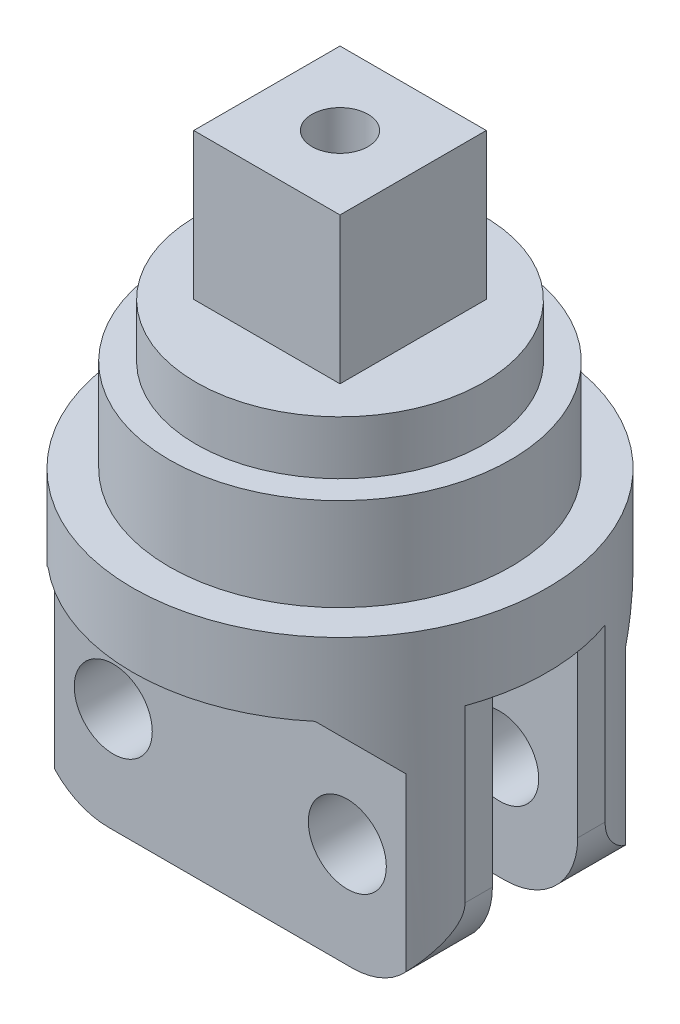
ISO-10303-21;
HEADER;
FILE_DESCRIPTION(('STEP AP214'),'2;1');
FILE_NAME('part.step','',(''),(''),'','','');
FILE_SCHEMA(('AUTOMOTIVE_DESIGN { 1 0 10303 214 1 1 1 1 }'));
ENDSEC;
DATA;
#1=APPLICATION_CONTEXT('core data for automotive mechanical design processes');
#2=APPLICATION_PROTOCOL_DEFINITION('international standard','automotive_design',2000,#1);
#3=PRODUCT_CONTEXT('',#1,'mechanical');
#4=PRODUCT('Part','Part','',(#3));
#5=PRODUCT_RELATED_PRODUCT_CATEGORY('part','',(#4));
#6=PRODUCT_DEFINITION_FORMATION('','',#4);
#7=PRODUCT_DEFINITION_CONTEXT('part definition',#1,'design');
#8=PRODUCT_DEFINITION('design','',#6,#7);
#9=PRODUCT_DEFINITION_SHAPE('','',#8);
#10=(LENGTH_UNIT() NAMED_UNIT(*) SI_UNIT(.MILLI.,.METRE.));
#11=(NAMED_UNIT(*) PLANE_ANGLE_UNIT() SI_UNIT($,.RADIAN.));
#12=(NAMED_UNIT(*) SI_UNIT($,.STERADIAN.) SOLID_ANGLE_UNIT());
#13=UNCERTAINTY_MEASURE_WITH_UNIT(LENGTH_MEASURE(1.E-05),#10,'distance_accuracy_value','');
#14=(GEOMETRIC_REPRESENTATION_CONTEXT(3) GLOBAL_UNCERTAINTY_ASSIGNED_CONTEXT((#13)) GLOBAL_UNIT_ASSIGNED_CONTEXT((#10,
#11,#12)) REPRESENTATION_CONTEXT('',''));
#15=CARTESIAN_POINT('',(0.,0.,0.));
#16=DIRECTION('',(0.,0.,1.));
#17=DIRECTION('',(1.,0.,0.));
#18=AXIS2_PLACEMENT_3D('',#15,#16,#17);
#19=CARTESIAN_POINT('',(0.,9.,0.));
#20=DIRECTION('',(0.,1.,0.));
#21=DIRECTION('',(0.,0.,1.));
#22=AXIS2_PLACEMENT_3D('',#19,#20,#21);
#23=PLANE('',#22);
#24=CARTESIAN_POINT('',(0.,9.,0.));
#25=DIRECTION('',(0.,1.,0.));
#26=DIRECTION('',(0.,0.,1.));
#27=AXIS2_PLACEMENT_3D('',#24,#25,#26);
#28=CIRCLE('',#27,5.9);
#29=CARTESIAN_POINT('',(0.,9.,5.9));
#30=VERTEX_POINT('',#29);
#31=EDGE_CURVE('E209',#30,#30,#28,.T.);
#32=ORIENTED_EDGE('',*,*,#31,.T.);
#33=EDGE_LOOP('',(#32));
#34=FACE_BOUND('',#33,.T.);
#35=DIRECTION('',(-1.,0.,0.));
#36=VECTOR('',#35,1.);
#37=CARTESIAN_POINT('',(-3.,9.,-3.));
#38=LINE('',#37,#36);
#39=CARTESIAN_POINT('',(3.,9.,-3.));
#40=VERTEX_POINT('',#39);
#41=CARTESIAN_POINT('',(-3.,9.,-3.));
#42=VERTEX_POINT('',#41);
#43=EDGE_CURVE('E784',#40,#42,#38,.T.);
#44=ORIENTED_EDGE('',*,*,#43,.F.);
#45=DIRECTION('',(0.,0.,-1.));
#46=VECTOR('',#45,1.);
#47=CARTESIAN_POINT('',(3.,9.,-3.));
#48=LINE('',#47,#46);
#49=CARTESIAN_POINT('',(3.,9.,3.));
#50=VERTEX_POINT('',#49);
#51=EDGE_CURVE('E207',#50,#40,#48,.T.);
#52=ORIENTED_EDGE('',*,*,#51,.F.);
#53=DIRECTION('',(1.,0.,0.));
#54=VECTOR('',#53,1.);
#55=CARTESIAN_POINT('',(-3.,9.,3.));
#56=LINE('',#55,#54);
#57=CARTESIAN_POINT('',(-3.,9.,3.));
#58=VERTEX_POINT('',#57);
#59=EDGE_CURVE('E203',#58,#50,#56,.T.);
#60=ORIENTED_EDGE('',*,*,#59,.F.);
#61=DIRECTION('',(0.,0.,1.));
#62=VECTOR('',#61,1.);
#63=CARTESIAN_POINT('',(-3.,9.,-3.));
#64=LINE('',#63,#62);
#65=EDGE_CURVE('E782',#42,#58,#64,.T.);
#66=ORIENTED_EDGE('',*,*,#65,.F.);
#67=EDGE_LOOP('',(#44,#52,#60,#66));
#68=FACE_BOUND('',#67,.T.);
#69=ADVANCED_FACE('F36',(#34,#68),#23,.T.);
#70=CARTESIAN_POINT('',(0.,9.,0.));
#71=DIRECTION('',(0.,-1.,0.));
#72=DIRECTION('',(0.,0.,-1.));
#73=AXIS2_PLACEMENT_3D('',#70,#71,#72);
#74=CYLINDRICAL_SURFACE('',#73,7.);
#75=CARTESIAN_POINT('',(0.,3.,0.));
#76=DIRECTION('',(0.,1.,0.));
#77=DIRECTION('',(0.,0.,1.));
#78=AXIS2_PLACEMENT_3D('',#75,#76,#77);
#79=CIRCLE('',#78,7.);
#80=CARTESIAN_POINT('',(0.,3.,7.));
#81=VERTEX_POINT('',#80);
#82=EDGE_CURVE('E489',#81,#81,#79,.T.);
#83=ORIENTED_EDGE('',*,*,#82,.T.);
#84=EDGE_LOOP('',(#83));
#85=FACE_BOUND('',#84,.T.);
#86=CARTESIAN_POINT('',(0.,6.8,0.));
#87=DIRECTION('',(0.,1.,0.));
#88=DIRECTION('',(0.,0.,1.));
#89=AXIS2_PLACEMENT_3D('',#86,#87,#88);
#90=CIRCLE('',#89,7.);
#91=CARTESIAN_POINT('',(0.,6.8,7.));
#92=VERTEX_POINT('',#91);
#93=EDGE_CURVE('E219',#92,#92,#90,.T.);
#94=ORIENTED_EDGE('',*,*,#93,.F.);
#95=EDGE_LOOP('',(#94));
#96=FACE_BOUND('',#95,.T.);
#97=ADVANCED_FACE('F299',(#85,#96),#74,.T.);
#98=CARTESIAN_POINT('',(-8.,-10.,-4.5));
#99=DIRECTION('',(1.,0.,0.));
#100=DIRECTION('',(0.,0.,-1.));
#101=AXIS2_PLACEMENT_3D('',#98,#99,#100);
#102=PLANE('',#101);
#103=DIRECTION('',(0.,-1.,0.));
#104=VECTOR('',#103,1.);
#105=CARTESIAN_POINT('',(-8.,10.,-2.87228132326903));
#106=LINE('',#105,#104);
#107=CARTESIAN_POINT('',(-8.,-7.,-2.87228132326903));
#108=VERTEX_POINT('',#107);
#109=CARTESIAN_POINT('',(-8.,0.,-2.87228132326903));
#110=VERTEX_POINT('',#109);
#111=EDGE_CURVE('E519',#108,#110,#106,.F.);
#112=ORIENTED_EDGE('',*,*,#111,.F.);
#113=DIRECTION('',(0.,0.,-1.));
#114=VECTOR('',#113,1.);
#115=CARTESIAN_POINT('',(-8.,-7.,-1.5));
#116=LINE('',#115,#114);
#117=CARTESIAN_POINT('',(-8.,-7.,-1.75));
#118=VERTEX_POINT('',#117);
#119=EDGE_CURVE('E339',#108,#118,#116,.F.);
#120=ORIENTED_EDGE('',*,*,#119,.T.);
#121=DIRECTION('',(0.,-1.,0.));
#122=VECTOR('',#121,1.);
#123=CARTESIAN_POINT('',(-8.,-10.,-1.75));
#124=LINE('',#123,#122);
#125=CARTESIAN_POINT('',(-8.,0.,-1.75));
#126=VERTEX_POINT('',#125);
#127=EDGE_CURVE('E454',#126,#118,#124,.T.);
#128=ORIENTED_EDGE('',*,*,#127,.F.);
#129=DIRECTION('',(0.,0.,-1.));
#130=VECTOR('',#129,1.);
#131=CARTESIAN_POINT('',(-8.,0.,-4.5));
#132=LINE('',#131,#130);
#133=EDGE_CURVE('E481',#126,#110,#132,.T.);
#134=ORIENTED_EDGE('',*,*,#133,.T.);
#135=EDGE_LOOP('',(#112,#120,#128,#134));
#136=FACE_BOUND('',#135,.T.);
#137=ADVANCED_FACE('F305',(#136),#102,.F.);
#138=CARTESIAN_POINT('',(8.,-10.,-4.5));
#139=DIRECTION('',(-1.,0.,0.));
#140=DIRECTION('',(0.,0.,1.));
#141=AXIS2_PLACEMENT_3D('',#138,#139,#140);
#142=PLANE('',#141);
#143=DIRECTION('',(0.,-1.,0.));
#144=VECTOR('',#143,1.);
#145=CARTESIAN_POINT('',(8.,10.,-2.872281323269));
#146=LINE('',#145,#144);
#147=CARTESIAN_POINT('',(8.,0.,-2.872281323269));
#148=VERTEX_POINT('',#147);
#149=CARTESIAN_POINT('',(8.,-7.,-2.872281323269));
#150=VERTEX_POINT('',#149);
#151=EDGE_CURVE('E512',#148,#150,#146,.T.);
#152=ORIENTED_EDGE('',*,*,#151,.F.);
#153=DIRECTION('',(0.,0.,1.));
#154=VECTOR('',#153,1.);
#155=CARTESIAN_POINT('',(8.,0.,-4.5));
#156=LINE('',#155,#154);
#157=CARTESIAN_POINT('',(8.,0.,-1.75));
#158=VERTEX_POINT('',#157);
#159=EDGE_CURVE('E492',#148,#158,#156,.T.);
#160=ORIENTED_EDGE('',*,*,#159,.T.);
#161=DIRECTION('',(0.,1.,0.));
#162=VECTOR('',#161,1.);
#163=CARTESIAN_POINT('',(8.,-10.,-1.75));
#164=LINE('',#163,#162);
#165=CARTESIAN_POINT('',(8.,-7.,-1.75));
#166=VERTEX_POINT('',#165);
#167=EDGE_CURVE('E450',#166,#158,#164,.T.);
#168=ORIENTED_EDGE('',*,*,#167,.F.);
#169=DIRECTION('',(0.,0.,1.));
#170=VECTOR('',#169,1.);
#171=CARTESIAN_POINT('',(8.,-7.,-4.12310562561765));
#172=LINE('',#171,#170);
#173=EDGE_CURVE('E348',#166,#150,#172,.F.);
#174=ORIENTED_EDGE('',*,*,#173,.T.);
#175=EDGE_LOOP('',(#152,#160,#168,#174));
#176=FACE_BOUND('',#175,.T.);
#177=ADVANCED_FACE('F510',(#176),#142,.F.);
#178=CARTESIAN_POINT('',(-8.,-10.,1.5));
#179=DIRECTION('',(1.,0.,0.));
#180=DIRECTION('',(0.,0.,-1.));
#181=AXIS2_PLACEMENT_3D('',#178,#179,#180);
#182=PLANE('',#181);
#183=DIRECTION('',(0.,-1.,0.));
#184=VECTOR('',#183,1.);
#185=CARTESIAN_POINT('',(-8.,10.,2.872281323269));
#186=LINE('',#185,#184);
#187=CARTESIAN_POINT('',(-8.,0.,2.87228132326901));
#188=VERTEX_POINT('',#187);
#189=CARTESIAN_POINT('',(-8.,-7.,2.872281323269));
#190=VERTEX_POINT('',#189);
#191=EDGE_CURVE('E272',#188,#190,#186,.T.);
#192=ORIENTED_EDGE('',*,*,#191,.F.);
#193=DIRECTION('',(0.,0.,-1.));
#194=VECTOR('',#193,1.);
#195=CARTESIAN_POINT('',(-8.,0.,1.5));
#196=LINE('',#195,#194);
#197=CARTESIAN_POINT('',(-8.,0.,1.75));
#198=VERTEX_POINT('',#197);
#199=EDGE_CURVE('E477',#188,#198,#196,.T.);
#200=ORIENTED_EDGE('',*,*,#199,.T.);
#201=DIRECTION('',(0.,1.,0.));
#202=VECTOR('',#201,1.);
#203=CARTESIAN_POINT('',(-8.,-10.,1.75));
#204=LINE('',#203,#202);
#205=CARTESIAN_POINT('',(-8.,-7.,1.75));
#206=VERTEX_POINT('',#205);
#207=EDGE_CURVE('E432',#206,#198,#204,.T.);
#208=ORIENTED_EDGE('',*,*,#207,.F.);
#209=DIRECTION('',(0.,0.,-1.));
#210=VECTOR('',#209,1.);
#211=CARTESIAN_POINT('',(-8.,-7.,4.12310562561765));
#212=LINE('',#211,#210);
#213=EDGE_CURVE('E369',#206,#190,#212,.F.);
#214=ORIENTED_EDGE('',*,*,#213,.T.);
#215=EDGE_LOOP('',(#192,#200,#208,#214));
#216=FACE_BOUND('',#215,.T.);
#217=ADVANCED_FACE('F333',(#216),#182,.F.);
#218=CARTESIAN_POINT('',(8.,-10.,1.5));
#219=DIRECTION('',(-1.,0.,0.));
#220=DIRECTION('',(0.,0.,1.));
#221=AXIS2_PLACEMENT_3D('',#218,#219,#220);
#222=PLANE('',#221);
#223=DIRECTION('',(0.,-1.,0.));
#224=VECTOR('',#223,1.);
#225=CARTESIAN_POINT('',(8.,10.,2.87228132326903));
#226=LINE('',#225,#224);
#227=CARTESIAN_POINT('',(8.,-7.,2.87228132326903));
#228=VERTEX_POINT('',#227);
#229=CARTESIAN_POINT('',(8.,0.,2.87228132326903));
#230=VERTEX_POINT('',#229);
#231=EDGE_CURVE('E523',#228,#230,#226,.F.);
#232=ORIENTED_EDGE('',*,*,#231,.F.);
#233=DIRECTION('',(0.,0.,1.));
#234=VECTOR('',#233,1.);
#235=CARTESIAN_POINT('',(8.,-7.,1.5));
#236=LINE('',#235,#234);
#237=CARTESIAN_POINT('',(8.,-7.,1.75));
#238=VERTEX_POINT('',#237);
#239=EDGE_CURVE('E367',#228,#238,#236,.F.);
#240=ORIENTED_EDGE('',*,*,#239,.T.);
#241=DIRECTION('',(0.,-1.,0.));
#242=VECTOR('',#241,1.);
#243=CARTESIAN_POINT('',(8.,-10.,1.75));
#244=LINE('',#243,#242);
#245=CARTESIAN_POINT('',(8.,0.,1.75));
#246=VERTEX_POINT('',#245);
#247=EDGE_CURVE('E438',#246,#238,#244,.T.);
#248=ORIENTED_EDGE('',*,*,#247,.F.);
#249=DIRECTION('',(0.,0.,1.));
#250=VECTOR('',#249,1.);
#251=CARTESIAN_POINT('',(8.,0.,1.5));
#252=LINE('',#251,#250);
#253=EDGE_CURVE('E482',#246,#230,#252,.T.);
#254=ORIENTED_EDGE('',*,*,#253,.T.);
#255=EDGE_LOOP('',(#232,#240,#248,#254));
#256=FACE_BOUND('',#255,.T.);
#257=ADVANCED_FACE('F326',(#256),#222,.F.);
#258=CARTESIAN_POINT('',(-5.,-7.,0.));
#259=DIRECTION('',(0.,0.,1.));
#260=DIRECTION('',(1.,0.,0.));
#261=AXIS2_PLACEMENT_3D('',#258,#259,#260);
#262=CYLINDRICAL_SURFACE('',#261,3.);
#263=ORIENTED_EDGE('',*,*,#119,.F.);
#264=CARTESIAN_POINT('',(-8.,-7.,-2.87228132326903));
#265=CARTESIAN_POINT('',(-8.00000569427768,-7.03506905212938,-2.87225967257194));
#266=CARTESIAN_POINT('',(-7.99938472307161,-7.07011021282513,-2.87399538458276));
#267=CARTESIAN_POINT('',(-7.99694398080835,-7.13975191993636,-2.88078245860139));
#268=CARTESIAN_POINT('',(-7.99512687440453,-7.17435327187971,-2.88582645060029));
#269=CARTESIAN_POINT('',(-7.98805067528725,-7.27583480395914,-2.90538097470235));
#270=CARTESIAN_POINT('',(-7.98116199122646,-7.34176545210072,-2.92433052245145));
#271=CARTESIAN_POINT('',(-7.96057168515729,-7.49272115908237,-2.98000624580748));
#272=CARTESIAN_POINT('',(-7.94530591478111,-7.57600937462241,-3.02068563713393));
#273=CARTESIAN_POINT('',(-7.9095538723308,-7.7357138568931,-3.11310775913705));
#274=CARTESIAN_POINT('',(-7.88901906047421,-7.81205676944458,-3.16495259380615));
#275=CARTESIAN_POINT('',(-7.84320767238728,-7.96039376136287,-3.27686743803268));
#276=CARTESIAN_POINT('',(-7.81781322704846,-8.03220332767722,-3.33712888025405));
#277=CARTESIAN_POINT('',(-7.76328014216404,-8.1703853315131,-3.46210118262401));
#278=CARTESIAN_POINT('',(-7.73413735654142,-8.23675161300195,-3.52681693231515));
#279=CARTESIAN_POINT('',(-7.67246780845874,-8.36490566492953,-3.65903842999885));
#280=CARTESIAN_POINT('',(-7.63994182263847,-8.42669448060902,-3.72654353553798));
#281=CARTESIAN_POINT('',(-7.571671061097,-8.54636642649734,-3.86337303101687));
#282=CARTESIAN_POINT('',(-7.53592558280401,-8.6042486993588,-3.93269781570486));
#283=CARTESIAN_POINT('',(-7.45481210609312,-8.72631870941366,-4.08465652311887));
#284=CARTESIAN_POINT('',(-7.40885292476829,-8.78984671768929,-4.16750388887935));
#285=CARTESIAN_POINT('',(-7.31296951299627,-8.91209786456272,-4.33355156283422));
#286=CARTESIAN_POINT('',(-7.2630696466283,-8.97084657202947,-4.41674708923444));
#287=CARTESIAN_POINT('',(-7.21110255092798,-9.02756640070795,-4.5));
#288=B_SPLINE_CURVE_WITH_KNOTS('',3,(#264,#265,#266,#267,#268,#269,#270,#271,#272,#273,#274,
#275,#276,#277,#278,#279,#280,#281,#282,#283,#284,#285,#286,#287),.UNSPECIFIED.,.F.,.F.,(4,2,2,
2,2,2,2,2,2,2,2,4),(0.,0.105110190202452,0.209987013275182,0.415694603893059,0.695934403740005,
0.978854830170909,1.26979165230439,1.56105309554696,1.85224782441868,2.14350625376545,
2.485536895968,2.82559739746302),.UNSPECIFIED.);
#289=CARTESIAN_POINT('',(-7.21110255092798,-9.02756640070795,-4.5));
#290=VERTEX_POINT('',#289);
#291=EDGE_CURVE('E239',#108,#290,#288,.T.);
#292=ORIENTED_EDGE('',*,*,#291,.T.);
#293=CARTESIAN_POINT('',(-5.,-7.,-4.5));
#294=DIRECTION('',(0.,0.,1.));
#295=DIRECTION('',(1.,0.,0.));
#296=AXIS2_PLACEMENT_3D('',#293,#294,#295);
#297=CIRCLE('',#296,3.);
#298=CARTESIAN_POINT('',(-5.,-10.,-4.5));
#299=VERTEX_POINT('',#298);
#300=EDGE_CURVE('E349',#299,#290,#297,.F.);
#301=ORIENTED_EDGE('',*,*,#300,.F.);
#302=DIRECTION('',(0.,0.,-1.));
#303=VECTOR('',#302,1.);
#304=CARTESIAN_POINT('',(-5.,-10.,-4.12310562561766));
#305=LINE('',#304,#303);
#306=CARTESIAN_POINT('',(-5.,-10.,-1.75));
#307=VERTEX_POINT('',#306);
#308=EDGE_CURVE('E500',#307,#299,#305,.T.);
#309=ORIENTED_EDGE('',*,*,#308,.F.);
#310=CARTESIAN_POINT('',(-5.,-7.,-1.75));
#311=DIRECTION('',(0.,0.,1.));
#312=DIRECTION('',(1.,0.,0.));
#313=AXIS2_PLACEMENT_3D('',#310,#311,#312);
#314=CIRCLE('',#313,3.);
#315=EDGE_CURVE('E343',#307,#118,#314,.F.);
#316=ORIENTED_EDGE('',*,*,#315,.T.);
#317=EDGE_LOOP('',(#263,#292,#301,#309,#316));
#318=FACE_BOUND('',#317,.T.);
#319=ADVANCED_FACE('F323',(#318),#262,.T.);
#320=CARTESIAN_POINT('',(5.,-7.,0.));
#321=DIRECTION('',(0.,0.,-1.));
#322=DIRECTION('',(-1.,0.,0.));
#323=AXIS2_PLACEMENT_3D('',#320,#321,#322);
#324=CYLINDRICAL_SURFACE('',#323,3.);
#325=CARTESIAN_POINT('',(5.,-7.,-4.5));
#326=DIRECTION('',(0.,0.,1.));
#327=DIRECTION('',(1.,0.,0.));
#328=AXIS2_PLACEMENT_3D('',#325,#326,#327);
#329=CIRCLE('',#328,3.);
#330=CARTESIAN_POINT('',(7.21110255092798,-9.02756640070795,-4.5));
#331=VERTEX_POINT('',#330);
#332=CARTESIAN_POINT('',(5.,-10.,-4.5));
#333=VERTEX_POINT('',#332);
#334=EDGE_CURVE('E354',#331,#333,#329,.F.);
#335=ORIENTED_EDGE('',*,*,#334,.F.);
#336=CARTESIAN_POINT('',(7.21110255092798,-9.02756640070795,-4.5));
#337=CARTESIAN_POINT('',(7.23976797649999,-8.99630349945521,-4.45406517397647));
#338=CARTESIAN_POINT('',(7.26779824111263,-8.96440810049003,-4.40816944092347));
#339=CARTESIAN_POINT('',(7.32259074926525,-8.89931146997209,-4.31653967232921));
#340=CARTESIAN_POINT('',(7.34935287377765,-8.86611011637561,-4.27080565233766));
#341=CARTESIAN_POINT('',(7.42790298907365,-8.76427392908799,-4.13368694888336));
#342=CARTESIAN_POINT('',(7.47776773843927,-8.69361033890767,-4.04268635341385));
#343=CARTESIAN_POINT('',(7.57309114239042,-8.54503554295237,-3.86121458899551));
#344=CARTESIAN_POINT('',(7.61845688529601,-8.46701873103191,-3.77078087681754));
#345=CARTESIAN_POINT('',(7.70344134955288,-8.30379326861657,-3.59396179504759));
#346=CARTESIAN_POINT('',(7.74306918354839,-8.21859636935391,-3.50757015710986));
#347=CARTESIAN_POINT('',(7.80675306989303,-8.0617727356429,-3.36291334085474));
#348=CARTESIAN_POINT('',(7.83220953058583,-7.99218395190936,-3.30307143654337));
#349=CARTESIAN_POINT('',(7.87904747833435,-7.846713373363,-3.18972482197842));
#350=CARTESIAN_POINT('',(7.90043348435864,-7.7708386930394,-3.13621310931058));
#351=CARTESIAN_POINT('',(7.93460034886727,-7.62652307416383,-3.04859037838577));
#352=CARTESIAN_POINT('',(7.94824335168555,-7.55937558670473,-3.01272367397886));
#353=CARTESIAN_POINT('',(7.9712759048221,-7.42005906015097,-2.95124367961165));
#354=CARTESIAN_POINT('',(7.9806885660205,-7.34791985280471,-2.92557476948133));
#355=CARTESIAN_POINT('',(7.99155164749183,-7.22935384141561,-2.8957302846945));
#356=CARTESIAN_POINT('',(7.99468130841289,-7.1842123400421,-2.88706358449622));
#357=CARTESIAN_POINT('',(7.99892315693058,-7.09274637070571,-2.87528105716221));
#358=CARTESIAN_POINT('',(8.0000183850101,-7.04641519415157,-2.87221189625681));
#359=CARTESIAN_POINT('',(8.,-7.,-2.87228132326901));
#360=B_SPLINE_CURVE_WITH_KNOTS('',3,(#336,#337,#338,#339,#340,#341,#342,#343,#344,#345,#346,
#347,#348,#349,#350,#351,#352,#353,#354,#355,#356,#357,#358,#359),.UNSPECIFIED.,.F.,.F.,(4,2,2,
2,2,2,2,2,2,2,2,4),(0.,0.187553675331959,0.375124919715864,0.751490607417803,1.1344753404665,
1.51684500437166,1.8022446929293,2.08732566214559,2.3186861985701,2.54876694448898,
2.68661452623785,2.82560616872196),.UNSPECIFIED.);
#361=EDGE_CURVE('E231',#331,#150,#360,.T.);
#362=ORIENTED_EDGE('',*,*,#361,.T.);
#363=ORIENTED_EDGE('',*,*,#173,.F.);
#364=CARTESIAN_POINT('',(5.,-7.,-1.75));
#365=DIRECTION('',(0.,0.,1.));
#366=DIRECTION('',(1.,0.,0.));
#367=AXIS2_PLACEMENT_3D('',#364,#365,#366);
#368=CIRCLE('',#367,3.);
#369=CARTESIAN_POINT('',(5.,-10.,-1.75));
#370=VERTEX_POINT('',#369);
#371=EDGE_CURVE('E375',#166,#370,#368,.F.);
#372=ORIENTED_EDGE('',*,*,#371,.T.);
#373=DIRECTION('',(0.,0.,1.));
#374=VECTOR('',#373,1.);
#375=CARTESIAN_POINT('',(5.,-10.,-1.5));
#376=LINE('',#375,#374);
#377=EDGE_CURVE('E494',#333,#370,#376,.T.);
#378=ORIENTED_EDGE('',*,*,#377,.F.);
#379=EDGE_LOOP('',(#335,#362,#363,#372,#378));
#380=FACE_BOUND('',#379,.T.);
#381=ADVANCED_FACE('F245',(#380),#324,.T.);
#382=CARTESIAN_POINT('',(5.,-7.,0.));
#383=DIRECTION('',(0.,0.,-1.));
#384=DIRECTION('',(-1.,0.,0.));
#385=AXIS2_PLACEMENT_3D('',#382,#383,#384);
#386=CYLINDRICAL_SURFACE('',#385,3.);
#387=ORIENTED_EDGE('',*,*,#239,.F.);
#388=CARTESIAN_POINT('',(8.,-7.,2.87228132326903));
#389=CARTESIAN_POINT('',(8.00000569427768,-7.03506905212938,2.87225967257194));
#390=CARTESIAN_POINT('',(7.99938472307161,-7.07011021282513,2.87399538458276));
#391=CARTESIAN_POINT('',(7.99694398080835,-7.13975191993636,2.88078245860139));
#392=CARTESIAN_POINT('',(7.99512687440453,-7.17435327187971,2.88582645060029));
#393=CARTESIAN_POINT('',(7.98805067528725,-7.27583480395914,2.90538097470235));
#394=CARTESIAN_POINT('',(7.98116199122646,-7.34176545210072,2.92433052245145));
#395=CARTESIAN_POINT('',(7.96057168515729,-7.49272115908237,2.98000624580748));
#396=CARTESIAN_POINT('',(7.94530591478111,-7.57600937462241,3.02068563713393));
#397=CARTESIAN_POINT('',(7.9095538723308,-7.7357138568931,3.11310775913705));
#398=CARTESIAN_POINT('',(7.88901906047421,-7.81205676944458,3.16495259380615));
#399=CARTESIAN_POINT('',(7.84320767238728,-7.96039376136287,3.27686743803268));
#400=CARTESIAN_POINT('',(7.81781322704846,-8.03220332767722,3.33712888025405));
#401=CARTESIAN_POINT('',(7.76328014216404,-8.1703853315131,3.46210118262401));
#402=CARTESIAN_POINT('',(7.73413735654142,-8.23675161300195,3.52681693231515));
#403=CARTESIAN_POINT('',(7.67246780845874,-8.36490566492953,3.65903842999885));
#404=CARTESIAN_POINT('',(7.63994182263847,-8.42669448060902,3.72654353553798));
#405=CARTESIAN_POINT('',(7.571671061097,-8.54636642649734,3.86337303101687));
#406=CARTESIAN_POINT('',(7.53592558280401,-8.6042486993588,3.93269781570486));
#407=CARTESIAN_POINT('',(7.45481210609312,-8.72631870941366,4.08465652311887));
#408=CARTESIAN_POINT('',(7.40885292476829,-8.78984671768929,4.16750388887935));
#409=CARTESIAN_POINT('',(7.31296951299627,-8.91209786456272,4.33355156283422));
#410=CARTESIAN_POINT('',(7.2630696466283,-8.97084657202947,4.41674708923444));
#411=CARTESIAN_POINT('',(7.21110255092798,-9.02756640070795,4.5));
#412=B_SPLINE_CURVE_WITH_KNOTS('',3,(#388,#389,#390,#391,#392,#393,#394,#395,#396,#397,#398,
#399,#400,#401,#402,#403,#404,#405,#406,#407,#408,#409,#410,#411),.UNSPECIFIED.,.F.,.F.,(4,2,2,
2,2,2,2,2,2,2,2,4),(0.,0.105110190202452,0.209987013275182,0.415694603893059,0.695934403740005,
0.978854830170909,1.26979165230439,1.56105309554696,1.85224782441868,2.14350625376545,
2.485536895968,2.82559739746302),.UNSPECIFIED.);
#413=CARTESIAN_POINT('',(7.21110255092798,-9.02756640070795,4.5));
#414=VERTEX_POINT('',#413);
#415=EDGE_CURVE('E271',#228,#414,#412,.T.);
#416=ORIENTED_EDGE('',*,*,#415,.T.);
#417=CARTESIAN_POINT('',(5.,-7.,4.5));
#418=DIRECTION('',(0.,0.,-1.));
#419=DIRECTION('',(-1.,0.,0.));
#420=AXIS2_PLACEMENT_3D('',#417,#418,#419);
#421=CIRCLE('',#420,3.);
#422=CARTESIAN_POINT('',(5.,-10.,4.5));
#423=VERTEX_POINT('',#422);
#424=EDGE_CURVE('E364',#423,#414,#421,.F.);
#425=ORIENTED_EDGE('',*,*,#424,.F.);
#426=DIRECTION('',(0.,0.,1.));
#427=VECTOR('',#426,1.);
#428=CARTESIAN_POINT('',(5.,-10.,4.12310562561766));
#429=LINE('',#428,#427);
#430=CARTESIAN_POINT('',(5.,-10.,1.75));
#431=VERTEX_POINT('',#430);
#432=EDGE_CURVE('E360',#431,#423,#429,.T.);
#433=ORIENTED_EDGE('',*,*,#432,.F.);
#434=CARTESIAN_POINT('',(5.,-7.,1.75));
#435=DIRECTION('',(0.,0.,-1.));
#436=DIRECTION('',(-1.,0.,0.));
#437=AXIS2_PLACEMENT_3D('',#434,#435,#436);
#438=CIRCLE('',#437,3.);
#439=EDGE_CURVE('E435',#431,#238,#438,.F.);
#440=ORIENTED_EDGE('',*,*,#439,.T.);
#441=EDGE_LOOP('',(#387,#416,#425,#433,#440));
#442=FACE_BOUND('',#441,.T.);
#443=ADVANCED_FACE('F282',(#442),#386,.T.);
#444=CARTESIAN_POINT('',(-5.,-7.,0.));
#445=DIRECTION('',(0.,0.,1.));
#446=DIRECTION('',(1.,0.,0.));
#447=AXIS2_PLACEMENT_3D('',#444,#445,#446);
#448=CYLINDRICAL_SURFACE('',#447,3.);
#449=CARTESIAN_POINT('',(-5.,-7.,4.5));
#450=DIRECTION('',(0.,0.,-1.));
#451=DIRECTION('',(-1.,0.,0.));
#452=AXIS2_PLACEMENT_3D('',#449,#450,#451);
#453=CIRCLE('',#452,3.);
#454=CARTESIAN_POINT('',(-7.21110255092798,-9.02756640070795,4.5));
#455=VERTEX_POINT('',#454);
#456=CARTESIAN_POINT('',(-5.,-10.,4.5));
#457=VERTEX_POINT('',#456);
#458=EDGE_CURVE('E362',#455,#457,#453,.F.);
#459=ORIENTED_EDGE('',*,*,#458,.F.);
#460=CARTESIAN_POINT('',(-7.21110255092798,-9.02756640070795,4.5));
#461=CARTESIAN_POINT('',(-7.23976797649999,-8.99630349945521,4.45406517397647));
#462=CARTESIAN_POINT('',(-7.26779824111263,-8.96440810049003,4.40816944092347));
#463=CARTESIAN_POINT('',(-7.32259074926525,-8.89931146997209,4.31653967232921));
#464=CARTESIAN_POINT('',(-7.34935287377765,-8.86611011637561,4.27080565233766));
#465=CARTESIAN_POINT('',(-7.42790298907365,-8.764273929088,4.13368694888337));
#466=CARTESIAN_POINT('',(-7.47776773843927,-8.69361033890768,4.04268635341385));
#467=CARTESIAN_POINT('',(-7.57309114239042,-8.54503554295237,3.86121458899552));
#468=CARTESIAN_POINT('',(-7.61845688529601,-8.46701873103192,3.77078087681754));
#469=CARTESIAN_POINT('',(-7.70344134955288,-8.30379326861657,3.59396179504759));
#470=CARTESIAN_POINT('',(-7.74306918354838,-8.21859636935392,3.50757015710986));
#471=CARTESIAN_POINT('',(-7.80675306989303,-8.0617727356429,3.36291334085474));
#472=CARTESIAN_POINT('',(-7.83220953058583,-7.99218395190936,3.30307143654337));
#473=CARTESIAN_POINT('',(-7.87904747833435,-7.846713373363,3.18972482197842));
#474=CARTESIAN_POINT('',(-7.90043348435864,-7.7708386930394,3.13621310931058));
#475=CARTESIAN_POINT('',(-7.93460034886727,-7.62652307416383,3.04859037838577));
#476=CARTESIAN_POINT('',(-7.94824335168555,-7.55937558670473,3.01272367397886));
#477=CARTESIAN_POINT('',(-7.9712759048221,-7.42005906015098,2.95124367961165));
#478=CARTESIAN_POINT('',(-7.98068856602049,-7.34791985280471,2.92557476948133));
#479=CARTESIAN_POINT('',(-7.99155164749183,-7.22935384141561,2.8957302846945));
#480=CARTESIAN_POINT('',(-7.99468130841289,-7.1842123400421,2.88706358449622));
#481=CARTESIAN_POINT('',(-7.99892315693058,-7.09274637070571,2.87528105716221));
#482=CARTESIAN_POINT('',(-8.0000183850101,-7.04641519415158,2.87221189625681));
#483=CARTESIAN_POINT('',(-8.,-7.,2.87228132326901));
#484=B_SPLINE_CURVE_WITH_KNOTS('',3,(#460,#461,#462,#463,#464,#465,#466,#467,#468,#469,#470,
#471,#472,#473,#474,#475,#476,#477,#478,#479,#480,#481,#482,#483),.UNSPECIFIED.,.F.,.F.,(4,2,2,
2,2,2,2,2,2,2,2,4),(0.,0.187553675331959,0.375124919715864,0.751490607417801,1.1344753404665,
1.51684500437166,1.8022446929293,2.08732566214559,2.3186861985701,2.54876694448898,
2.68661452623785,2.82560616872196),.UNSPECIFIED.);
#485=EDGE_CURVE('E264',#455,#190,#484,.T.);
#486=ORIENTED_EDGE('',*,*,#485,.T.);
#487=ORIENTED_EDGE('',*,*,#213,.F.);
#488=CARTESIAN_POINT('',(-5.,-7.,1.75));
#489=DIRECTION('',(0.,0.,-1.));
#490=DIRECTION('',(-1.,0.,0.));
#491=AXIS2_PLACEMENT_3D('',#488,#489,#490);
#492=CIRCLE('',#491,3.);
#493=CARTESIAN_POINT('',(-5.,-10.,1.75));
#494=VERTEX_POINT('',#493);
#495=EDGE_CURVE('E372',#206,#494,#492,.F.);
#496=ORIENTED_EDGE('',*,*,#495,.T.);
#497=DIRECTION('',(0.,0.,-1.));
#498=VECTOR('',#497,1.);
#499=CARTESIAN_POINT('',(-5.,-10.,1.5));
#500=LINE('',#499,#498);
#501=EDGE_CURVE('E352',#457,#494,#500,.T.);
#502=ORIENTED_EDGE('',*,*,#501,.F.);
#503=EDGE_LOOP('',(#459,#486,#487,#496,#502));
#504=FACE_BOUND('',#503,.T.);
#505=ADVANCED_FACE('F278',(#504),#448,.T.);
#506=CARTESIAN_POINT('',(8.,-10.,-4.5));
#507=DIRECTION('',(0.,0.,1.));
#508=DIRECTION('',(1.,0.,0.));
#509=AXIS2_PLACEMENT_3D('',#506,#507,#508);
#510=PLANE('',#509);
#511=CARTESIAN_POINT('',(-4.8,-5.7,-4.5));
#512=DIRECTION('',(0.,0.,1.));
#513=DIRECTION('',(1.,0.,0.));
#514=AXIS2_PLACEMENT_3D('',#511,#512,#513);
#515=CIRCLE('',#514,1.6);
#516=CARTESIAN_POINT('',(-3.2,-5.7,-4.5));
#517=VERTEX_POINT('',#516);
#518=EDGE_CURVE('E474',#517,#517,#515,.T.);
#519=ORIENTED_EDGE('',*,*,#518,.T.);
#520=EDGE_LOOP('',(#519));
#521=FACE_BOUND('',#520,.T.);
#522=CARTESIAN_POINT('',(4.8,-5.7,-4.5));
#523=DIRECTION('',(0.,0.,1.));
#524=DIRECTION('',(1.,0.,0.));
#525=AXIS2_PLACEMENT_3D('',#522,#523,#524);
#526=CIRCLE('',#525,1.6);
#527=CARTESIAN_POINT('',(6.4,-5.7,-4.5));
#528=VERTEX_POINT('',#527);
#529=EDGE_CURVE('E469',#528,#528,#526,.T.);
#530=ORIENTED_EDGE('',*,*,#529,.T.);
#531=EDGE_LOOP('',(#530));
#532=FACE_BOUND('',#531,.T.);
#533=DIRECTION('',(0.,-1.,0.));
#534=VECTOR('',#533,1.);
#535=CARTESIAN_POINT('',(-7.21110255092798,10.,-4.5));
#536=LINE('',#535,#534);
#537=CARTESIAN_POINT('',(-7.21110255092798,-2.00000000000002,-4.5));
#538=VERTEX_POINT('',#537);
#539=EDGE_CURVE('E229',#538,#290,#536,.T.);
#540=ORIENTED_EDGE('',*,*,#539,.F.);
#541=DIRECTION('',(1.,0.,0.));
#542=VECTOR('',#541,1.);
#543=CARTESIAN_POINT('',(7.21110255092798,-2.00000000000002,-4.5));
#544=LINE('',#543,#542);
#545=CARTESIAN_POINT('',(7.21110255092798,-2.00000000000002,-4.5));
#546=VERTEX_POINT('',#545);
#547=EDGE_CURVE('E378',#538,#546,#544,.T.);
#548=ORIENTED_EDGE('',*,*,#547,.T.);
#549=DIRECTION('',(0.,-1.,0.));
#550=VECTOR('',#549,1.);
#551=CARTESIAN_POINT('',(7.21110255092798,10.,-4.5));
#552=LINE('',#551,#550);
#553=EDGE_CURVE('E225',#331,#546,#552,.F.);
#554=ORIENTED_EDGE('',*,*,#553,.F.);
#555=ORIENTED_EDGE('',*,*,#334,.T.);
#556=DIRECTION('',(1.,0.,0.));
#557=VECTOR('',#556,1.);
#558=CARTESIAN_POINT('',(8.,-10.,-4.5));
#559=LINE('',#558,#557);
#560=EDGE_CURVE('E486',#299,#333,#559,.T.);
#561=ORIENTED_EDGE('',*,*,#560,.F.);
#562=ORIENTED_EDGE('',*,*,#300,.T.);
#563=EDGE_LOOP('',(#540,#548,#554,#555,#561,#562));
#564=FACE_BOUND('',#563,.T.);
#565=ADVANCED_FACE('F281',(#521,#532,#564),#510,.F.);
#566=CARTESIAN_POINT('',(8.,-10.,4.5));
#567=DIRECTION('',(0.,0.,-1.));
#568=DIRECTION('',(-1.,0.,0.));
#569=AXIS2_PLACEMENT_3D('',#566,#567,#568);
#570=PLANE('',#569);
#571=CARTESIAN_POINT('',(-4.8,-5.7,4.5));
#572=DIRECTION('',(0.,0.,1.));
#573=DIRECTION('',(1.,0.,0.));
#574=AXIS2_PLACEMENT_3D('',#571,#572,#573);
#575=CIRCLE('',#574,1.6);
#576=CARTESIAN_POINT('',(-3.2,-5.7,4.5));
#577=VERTEX_POINT('',#576);
#578=EDGE_CURVE('E466',#577,#577,#575,.T.);
#579=ORIENTED_EDGE('',*,*,#578,.F.);
#580=EDGE_LOOP('',(#579));
#581=FACE_BOUND('',#580,.T.);
#582=CARTESIAN_POINT('',(4.8,-5.7,4.5));
#583=DIRECTION('',(0.,0.,1.));
#584=DIRECTION('',(1.,0.,0.));
#585=AXIS2_PLACEMENT_3D('',#582,#583,#584);
#586=CIRCLE('',#585,1.6);
#587=CARTESIAN_POINT('',(6.4,-5.7,4.5));
#588=VERTEX_POINT('',#587);
#589=EDGE_CURVE('E465',#588,#588,#586,.T.);
#590=ORIENTED_EDGE('',*,*,#589,.F.);
#591=EDGE_LOOP('',(#590));
#592=FACE_BOUND('',#591,.T.);
#593=DIRECTION('',(0.,-1.,0.));
#594=VECTOR('',#593,1.);
#595=CARTESIAN_POINT('',(7.21110255092798,10.,4.5));
#596=LINE('',#595,#594);
#597=CARTESIAN_POINT('',(7.21110255092798,-2.00000000000001,4.5));
#598=VERTEX_POINT('',#597);
#599=EDGE_CURVE('E412',#598,#414,#596,.T.);
#600=ORIENTED_EDGE('',*,*,#599,.F.);
#601=DIRECTION('',(-1.,0.,0.));
#602=VECTOR('',#601,1.);
#603=CARTESIAN_POINT('',(-7.21110255092798,-2.00000000000001,4.5));
#604=LINE('',#603,#602);
#605=CARTESIAN_POINT('',(-7.21110255092798,-2.00000000000001,4.5));
#606=VERTEX_POINT('',#605);
#607=EDGE_CURVE('E388',#598,#606,#604,.T.);
#608=ORIENTED_EDGE('',*,*,#607,.T.);
#609=DIRECTION('',(0.,-1.,0.));
#610=VECTOR('',#609,1.);
#611=CARTESIAN_POINT('',(-7.21110255092798,10.,4.5));
#612=LINE('',#611,#610);
#613=EDGE_CURVE('E421',#455,#606,#612,.F.);
#614=ORIENTED_EDGE('',*,*,#613,.F.);
#615=ORIENTED_EDGE('',*,*,#458,.T.);
#616=DIRECTION('',(-1.,0.,0.));
#617=VECTOR('',#616,1.);
#618=CARTESIAN_POINT('',(8.,-10.,4.5));
#619=LINE('',#618,#617);
#620=EDGE_CURVE('E478',#423,#457,#619,.T.);
#621=ORIENTED_EDGE('',*,*,#620,.F.);
#622=ORIENTED_EDGE('',*,*,#424,.T.);
#623=EDGE_LOOP('',(#600,#608,#614,#615,#621,#622));
#624=FACE_BOUND('',#623,.T.);
#625=ADVANCED_FACE('F321',(#581,#592,#624),#570,.F.);
#626=CARTESIAN_POINT('',(0.,0.,0.));
#627=DIRECTION('',(0.,1.,0.));
#628=DIRECTION('',(0.,0.,1.));
#629=AXIS2_PLACEMENT_3D('',#626,#627,#628);
#630=PLANE('',#629);
#631=CARTESIAN_POINT('',(0.,0.,0.));
#632=DIRECTION('',(0.,-1.,0.));
#633=DIRECTION('',(0.,0.,-1.));
#634=AXIS2_PLACEMENT_3D('',#631,#632,#633);
#635=CIRCLE('',#634,1.15);
#636=CARTESIAN_POINT('',(0.,0.,-1.15));
#637=VERTEX_POINT('',#636);
#638=EDGE_CURVE('E462',#637,#637,#635,.T.);
#639=ORIENTED_EDGE('',*,*,#638,.F.);
#640=EDGE_LOOP('',(#639));
#641=FACE_BOUND('',#640,.T.);
#642=CARTESIAN_POINT('',(0.,0.,0.));
#643=DIRECTION('',(0.,1.,0.));
#644=DIRECTION('',(0.,0.,1.));
#645=AXIS2_PLACEMENT_3D('',#642,#643,#644);
#646=CIRCLE('',#645,8.5);
#647=EDGE_CURVE('E516',#230,#148,#646,.T.);
#648=ORIENTED_EDGE('',*,*,#647,.F.);
#649=ORIENTED_EDGE('',*,*,#253,.F.);
#650=DIRECTION('',(-1.,0.,0.));
#651=VECTOR('',#650,1.);
#652=CARTESIAN_POINT('',(11.2166070642554,0.,1.75));
#653=LINE('',#652,#651);
#654=EDGE_CURVE('E426',#246,#198,#653,.T.);
#655=ORIENTED_EDGE('',*,*,#654,.T.);
#656=ORIENTED_EDGE('',*,*,#199,.F.);
#657=EDGE_CURVE('E520',#110,#188,#646,.T.);
#658=ORIENTED_EDGE('',*,*,#657,.F.);
#659=ORIENTED_EDGE('',*,*,#133,.F.);
#660=DIRECTION('',(1.,0.,0.));
#661=VECTOR('',#660,1.);
#662=CARTESIAN_POINT('',(11.2166070642554,0.,-1.75));
#663=LINE('',#662,#661);
#664=EDGE_CURVE('E411',#126,#158,#663,.T.);
#665=ORIENTED_EDGE('',*,*,#664,.T.);
#666=ORIENTED_EDGE('',*,*,#159,.F.);
#667=EDGE_LOOP('',(#648,#649,#655,#656,#658,#659,#665,#666));
#668=FACE_BOUND('',#667,.T.);
#669=ADVANCED_FACE('F318',(#641,#668),#630,.F.);
#670=CARTESIAN_POINT('',(0.,0.,0.));
#671=DIRECTION('',(0.,1.,0.));
#672=DIRECTION('',(0.,0.,1.));
#673=AXIS2_PLACEMENT_3D('',#670,#671,#672);
#674=CIRCLE('',#673,8.5);
#675=CARTESIAN_POINT('',(-5.47722557505167,0.,6.49999999999999));
#676=VERTEX_POINT('',#675);
#677=CARTESIAN_POINT('',(5.47722557505167,0.,6.49999999999999));
#678=VERTEX_POINT('',#677);
#679=EDGE_CURVE('E409',#676,#678,#674,.T.);
#680=ORIENTED_EDGE('',*,*,#679,.F.);
#681=DIRECTION('',(1.,0.,0.));
#682=VECTOR('',#681,1.);
#683=CARTESIAN_POINT('',(7.21110255092798,0.,6.49999999999999));
#684=LINE('',#683,#682);
#685=EDGE_CURVE('E50',#676,#678,#684,.T.);
#686=ORIENTED_EDGE('',*,*,#685,.T.);
#687=EDGE_LOOP('',(#680,#686));
#688=FACE_BOUND('',#687,.T.);
#689=ADVANCED_FACE('F320',(#688),#630,.F.);
#690=CARTESIAN_POINT('',(0.,0.,0.));
#691=DIRECTION('',(0.,1.,0.));
#692=DIRECTION('',(0.,0.,1.));
#693=AXIS2_PLACEMENT_3D('',#690,#691,#692);
#694=CIRCLE('',#693,8.5);
#695=CARTESIAN_POINT('',(5.47722557505167,0.,-6.49999999999999));
#696=VERTEX_POINT('',#695);
#697=CARTESIAN_POINT('',(-5.47722557505167,0.,-6.5));
#698=VERTEX_POINT('',#697);
#699=EDGE_CURVE('E221',#696,#698,#694,.T.);
#700=ORIENTED_EDGE('',*,*,#699,.F.);
#701=DIRECTION('',(-1.,0.,0.));
#702=VECTOR('',#701,1.);
#703=CARTESIAN_POINT('',(-7.21110255092798,0.,-6.5));
#704=LINE('',#703,#702);
#705=EDGE_CURVE('E386',#696,#698,#704,.T.);
#706=ORIENTED_EDGE('',*,*,#705,.T.);
#707=EDGE_LOOP('',(#700,#706));
#708=FACE_BOUND('',#707,.T.);
#709=ADVANCED_FACE('F316',(#708),#630,.F.);
#710=CARTESIAN_POINT('',(0.,3.,0.));
#711=DIRECTION('',(0.,1.,0.));
#712=DIRECTION('',(0.,0.,1.));
#713=AXIS2_PLACEMENT_3D('',#710,#711,#712);
#714=PLANE('',#713);
#715=ORIENTED_EDGE('',*,*,#82,.F.);
#716=EDGE_LOOP('',(#715));
#717=FACE_BOUND('',#716,.T.);
#718=CARTESIAN_POINT('',(0.,3.,0.));
#719=DIRECTION('',(0.,1.,0.));
#720=DIRECTION('',(0.,0.,1.));
#721=AXIS2_PLACEMENT_3D('',#718,#719,#720);
#722=CIRCLE('',#721,8.5);
#723=CARTESIAN_POINT('',(0.,3.,8.5));
#724=VERTEX_POINT('',#723);
#725=EDGE_CURVE('E226',#724,#724,#722,.T.);
#726=ORIENTED_EDGE('',*,*,#725,.T.);
#727=EDGE_LOOP('',(#726));
#728=FACE_BOUND('',#727,.T.);
#729=ADVANCED_FACE('F312',(#717,#728),#714,.T.);
#730=CARTESIAN_POINT('',(0.,-10.,0.));
#731=DIRECTION('',(0.,-1.,0.));
#732=DIRECTION('',(0.,0.,-1.));
#733=AXIS2_PLACEMENT_3D('',#730,#731,#732);
#734=PLANE('',#733);
#735=ORIENTED_EDGE('',*,*,#377,.T.);
#736=DIRECTION('',(-1.,0.,0.));
#737=VECTOR('',#736,1.);
#738=CARTESIAN_POINT('',(0.,-10.,-1.75));
#739=LINE('',#738,#737);
#740=EDGE_CURVE('E447',#370,#307,#739,.T.);
#741=ORIENTED_EDGE('',*,*,#740,.T.);
#742=ORIENTED_EDGE('',*,*,#308,.T.);
#743=ORIENTED_EDGE('',*,*,#560,.T.);
#744=EDGE_LOOP('',(#735,#741,#742,#743));
#745=FACE_BOUND('',#744,.T.);
#746=ADVANCED_FACE('F315',(#745),#734,.T.);
#747=CARTESIAN_POINT('',(0.,-10.,0.));
#748=DIRECTION('',(0.,-1.,0.));
#749=DIRECTION('',(0.,0.,-1.));
#750=AXIS2_PLACEMENT_3D('',#747,#748,#749);
#751=PLANE('',#750);
#752=ORIENTED_EDGE('',*,*,#501,.T.);
#753=DIRECTION('',(1.,0.,0.));
#754=VECTOR('',#753,1.);
#755=CARTESIAN_POINT('',(0.,-10.,1.75));
#756=LINE('',#755,#754);
#757=EDGE_CURVE('E429',#494,#431,#756,.T.);
#758=ORIENTED_EDGE('',*,*,#757,.T.);
#759=ORIENTED_EDGE('',*,*,#432,.T.);
#760=ORIENTED_EDGE('',*,*,#620,.T.);
#761=EDGE_LOOP('',(#752,#758,#759,#760));
#762=FACE_BOUND('',#761,.T.);
#763=ADVANCED_FACE('F539',(#762),#751,.T.);
#764=CARTESIAN_POINT('',(4.8,-5.7,-9.));
#765=DIRECTION('',(0.,0.,1.));
#766=DIRECTION('',(1.,0.,0.));
#767=AXIS2_PLACEMENT_3D('',#764,#765,#766);
#768=CYLINDRICAL_SURFACE('',#767,1.6);
#769=ORIENTED_EDGE('',*,*,#589,.T.);
#770=EDGE_LOOP('',(#769));
#771=FACE_BOUND('',#770,.T.);
#772=CARTESIAN_POINT('',(4.8,-5.7,1.75));
#773=DIRECTION('',(0.,0.,-1.));
#774=DIRECTION('',(-1.,0.,0.));
#775=AXIS2_PLACEMENT_3D('',#772,#773,#774);
#776=CIRCLE('',#775,1.6);
#777=CARTESIAN_POINT('',(3.2,-5.7,1.75));
#778=VERTEX_POINT('',#777);
#779=EDGE_CURVE('E444',#778,#778,#776,.F.);
#780=ORIENTED_EDGE('',*,*,#779,.F.);
#781=EDGE_LOOP('',(#780));
#782=FACE_BOUND('',#781,.T.);
#783=ADVANCED_FACE('F541',(#771,#782),#768,.F.);
#784=CARTESIAN_POINT('',(-4.8,-5.7,-9.));
#785=DIRECTION('',(0.,0.,1.));
#786=DIRECTION('',(1.,0.,0.));
#787=AXIS2_PLACEMENT_3D('',#784,#785,#786);
#788=CYLINDRICAL_SURFACE('',#787,1.6);
#789=ORIENTED_EDGE('',*,*,#578,.T.);
#790=EDGE_LOOP('',(#789));
#791=FACE_BOUND('',#790,.T.);
#792=CARTESIAN_POINT('',(-4.8,-5.7,1.75));
#793=DIRECTION('',(0.,0.,-1.));
#794=DIRECTION('',(-1.,0.,0.));
#795=AXIS2_PLACEMENT_3D('',#792,#793,#794);
#796=CIRCLE('',#795,1.6);
#797=CARTESIAN_POINT('',(-6.4,-5.7,1.75));
#798=VERTEX_POINT('',#797);
#799=EDGE_CURVE('E441',#798,#798,#796,.F.);
#800=ORIENTED_EDGE('',*,*,#799,.F.);
#801=EDGE_LOOP('',(#800));
#802=FACE_BOUND('',#801,.T.);
#803=ADVANCED_FACE('F547',(#791,#802),#788,.F.);
#804=ORIENTED_EDGE('',*,*,#529,.F.);
#805=EDGE_LOOP('',(#804));
#806=FACE_BOUND('',#805,.T.);
#807=CARTESIAN_POINT('',(4.8,-5.7,-1.75));
#808=DIRECTION('',(0.,0.,1.));
#809=DIRECTION('',(1.,0.,0.));
#810=AXIS2_PLACEMENT_3D('',#807,#808,#809);
#811=CIRCLE('',#810,1.6);
#812=CARTESIAN_POINT('',(6.4,-5.7,-1.75));
#813=VERTEX_POINT('',#812);
#814=EDGE_CURVE('E459',#813,#813,#811,.F.);
#815=ORIENTED_EDGE('',*,*,#814,.F.);
#816=EDGE_LOOP('',(#815));
#817=FACE_BOUND('',#816,.T.);
#818=ADVANCED_FACE('F550',(#806,#817),#768,.F.);
#819=ORIENTED_EDGE('',*,*,#518,.F.);
#820=EDGE_LOOP('',(#819));
#821=FACE_BOUND('',#820,.T.);
#822=CARTESIAN_POINT('',(-4.8,-5.7,-1.75));
#823=DIRECTION('',(0.,0.,1.));
#824=DIRECTION('',(1.,0.,0.));
#825=AXIS2_PLACEMENT_3D('',#822,#823,#824);
#826=CIRCLE('',#825,1.6);
#827=CARTESIAN_POINT('',(-3.2,-5.7,-1.75));
#828=VERTEX_POINT('',#827);
#829=EDGE_CURVE('E456',#828,#828,#826,.F.);
#830=ORIENTED_EDGE('',*,*,#829,.F.);
#831=EDGE_LOOP('',(#830));
#832=FACE_BOUND('',#831,.T.);
#833=ADVANCED_FACE('F570',(#821,#832),#788,.F.);
#834=CARTESIAN_POINT('',(0.,30.,0.));
#835=DIRECTION('',(0.,-1.,0.));
#836=DIRECTION('',(0.,0.,-1.));
#837=AXIS2_PLACEMENT_3D('',#834,#835,#836);
#838=CYLINDRICAL_SURFACE('',#837,1.15);
#839=ORIENTED_EDGE('',*,*,#638,.T.);
#840=EDGE_LOOP('',(#839));
#841=FACE_BOUND('',#840,.T.);
#842=CARTESIAN_POINT('',(0.,15.,0.));
#843=DIRECTION('',(0.,1.,0.));
#844=DIRECTION('',(0.,0.,1.));
#845=AXIS2_PLACEMENT_3D('',#842,#843,#844);
#846=CIRCLE('',#845,1.15);
#847=CARTESIAN_POINT('',(0.,15.,1.15));
#848=VERTEX_POINT('',#847);
#849=EDGE_CURVE('E793',#848,#848,#846,.T.);
#850=ORIENTED_EDGE('',*,*,#849,.T.);
#851=EDGE_LOOP('',(#850));
#852=FACE_BOUND('',#851,.T.);
#853=ADVANCED_FACE('F577',(#841,#852),#838,.F.);
#854=CARTESIAN_POINT('',(11.2166070642554,-20.,1.75));
#855=DIRECTION('',(0.,0.,-1.));
#856=DIRECTION('',(-1.,0.,0.));
#857=AXIS2_PLACEMENT_3D('',#854,#855,#856);
#858=PLANE('',#857);
#859=ORIENTED_EDGE('',*,*,#247,.T.);
#860=ORIENTED_EDGE('',*,*,#439,.F.);
#861=ORIENTED_EDGE('',*,*,#757,.F.);
#862=ORIENTED_EDGE('',*,*,#495,.F.);
#863=ORIENTED_EDGE('',*,*,#207,.T.);
#864=ORIENTED_EDGE('',*,*,#654,.F.);
#865=EDGE_LOOP('',(#859,#860,#861,#862,#863,#864));
#866=FACE_BOUND('',#865,.T.);
#867=ORIENTED_EDGE('',*,*,#799,.T.);
#868=EDGE_LOOP('',(#867));
#869=FACE_BOUND('',#868,.T.);
#870=ORIENTED_EDGE('',*,*,#779,.T.);
#871=EDGE_LOOP('',(#870));
#872=FACE_BOUND('',#871,.T.);
#873=ADVANCED_FACE('F257',(#866,#869,#872),#858,.T.);
#874=CARTESIAN_POINT('',(11.2166070642554,-20.,-1.75));
#875=DIRECTION('',(0.,0.,1.));
#876=DIRECTION('',(1.,0.,0.));
#877=AXIS2_PLACEMENT_3D('',#874,#875,#876);
#878=PLANE('',#877);
#879=ORIENTED_EDGE('',*,*,#127,.T.);
#880=ORIENTED_EDGE('',*,*,#315,.F.);
#881=ORIENTED_EDGE('',*,*,#740,.F.);
#882=ORIENTED_EDGE('',*,*,#371,.F.);
#883=ORIENTED_EDGE('',*,*,#167,.T.);
#884=ORIENTED_EDGE('',*,*,#664,.F.);
#885=EDGE_LOOP('',(#879,#880,#881,#882,#883,#884));
#886=FACE_BOUND('',#885,.T.);
#887=ORIENTED_EDGE('',*,*,#829,.T.);
#888=EDGE_LOOP('',(#887));
#889=FACE_BOUND('',#888,.T.);
#890=ORIENTED_EDGE('',*,*,#814,.T.);
#891=EDGE_LOOP('',(#890));
#892=FACE_BOUND('',#891,.T.);
#893=ADVANCED_FACE('F254',(#886,#889,#892),#878,.T.);
#894=CARTESIAN_POINT('',(0.,10.,0.));
#895=DIRECTION('',(0.,-1.,0.));
#896=DIRECTION('',(0.,0.,-1.));
#897=AXIS2_PLACEMENT_3D('',#894,#895,#896);
#898=CYLINDRICAL_SURFACE('',#897,8.5);
#899=ORIENTED_EDGE('',*,*,#725,.F.);
#900=EDGE_LOOP('',(#899));
#901=FACE_BOUND('',#900,.T.);
#902=ORIENTED_EDGE('',*,*,#613,.T.);
#903=CARTESIAN_POINT('',(0.,-6.50000000000006,0.));
#904=DIRECTION('',(0.,-0.707106781186544,0.707106781186551));
#905=DIRECTION('',(0.,-0.707106781186551,-0.707106781186544));
#906=AXIS2_PLACEMENT_3D('',#903,#904,#905);
#907=ELLIPSE('',#906,12.0208152801714,8.5);
#908=EDGE_CURVE('E44',#606,#676,#907,.F.);
#909=ORIENTED_EDGE('',*,*,#908,.T.);
#910=ORIENTED_EDGE('',*,*,#679,.T.);
#911=CARTESIAN_POINT('',(0.,-6.50000000000006,0.));
#912=DIRECTION('',(0.,-0.707106781186544,0.707106781186551));
#913=DIRECTION('',(0.,-0.707106781186551,-0.707106781186544));
#914=AXIS2_PLACEMENT_3D('',#911,#912,#913);
#915=ELLIPSE('',#914,12.0208152801714,8.5);
#916=EDGE_CURVE('E11',#678,#598,#915,.F.);
#917=ORIENTED_EDGE('',*,*,#916,.T.);
#918=ORIENTED_EDGE('',*,*,#599,.T.);
#919=ORIENTED_EDGE('',*,*,#415,.F.);
#920=ORIENTED_EDGE('',*,*,#231,.T.);
#921=ORIENTED_EDGE('',*,*,#647,.T.);
#922=ORIENTED_EDGE('',*,*,#151,.T.);
#923=ORIENTED_EDGE('',*,*,#361,.F.);
#924=ORIENTED_EDGE('',*,*,#553,.T.);
#925=CARTESIAN_POINT('',(0.,-6.50000000000007,0.));
#926=DIRECTION('',(0.,-0.707106781186543,-0.707106781186552));
#927=DIRECTION('',(0.,-0.707106781186552,0.707106781186543));
#928=AXIS2_PLACEMENT_3D('',#925,#926,#927);
#929=ELLIPSE('',#928,12.0208152801714,8.5);
#930=EDGE_CURVE('E392',#546,#696,#929,.F.);
#931=ORIENTED_EDGE('',*,*,#930,.T.);
#932=ORIENTED_EDGE('',*,*,#699,.T.);
#933=CARTESIAN_POINT('',(0.,-6.50000000000007,0.));
#934=DIRECTION('',(0.,-0.707106781186543,-0.707106781186552));
#935=DIRECTION('',(0.,-0.707106781186552,0.707106781186543));
#936=AXIS2_PLACEMENT_3D('',#933,#934,#935);
#937=ELLIPSE('',#936,12.0208152801714,8.5);
#938=EDGE_CURVE('E394',#698,#538,#937,.F.);
#939=ORIENTED_EDGE('',*,*,#938,.T.);
#940=ORIENTED_EDGE('',*,*,#539,.T.);
#941=ORIENTED_EDGE('',*,*,#291,.F.);
#942=ORIENTED_EDGE('',*,*,#111,.T.);
#943=ORIENTED_EDGE('',*,*,#657,.T.);
#944=ORIENTED_EDGE('',*,*,#191,.T.);
#945=ORIENTED_EDGE('',*,*,#485,.F.);
#946=EDGE_LOOP('',(#902,#909,#910,#917,#918,#919,#920,#921,#922,#923,#924,#931,#932,#939,#940,
#941,#942,#943,#944,#945));
#947=FACE_BOUND('',#946,.T.);
#948=ADVANCED_FACE('F248',(#901,#947),#898,.T.);
#949=CARTESIAN_POINT('',(0.,6.8,0.));
#950=DIRECTION('',(0.,1.,0.));
#951=DIRECTION('',(0.,0.,1.));
#952=AXIS2_PLACEMENT_3D('',#949,#950,#951);
#953=PLANE('',#952);
#954=CARTESIAN_POINT('',(0.,6.8,0.));
#955=DIRECTION('',(0.,1.,0.));
#956=DIRECTION('',(0.,0.,1.));
#957=AXIS2_PLACEMENT_3D('',#954,#955,#956);
#958=CIRCLE('',#957,5.9);
#959=CARTESIAN_POINT('',(0.,6.8,5.9));
#960=VERTEX_POINT('',#959);
#961=EDGE_CURVE('E212',#960,#960,#958,.T.);
#962=ORIENTED_EDGE('',*,*,#961,.F.);
#963=EDGE_LOOP('',(#962));
#964=FACE_BOUND('',#963,.T.);
#965=ORIENTED_EDGE('',*,*,#93,.T.);
#966=EDGE_LOOP('',(#965));
#967=FACE_BOUND('',#966,.T.);
#968=ADVANCED_FACE('F253',(#964,#967),#953,.T.);
#969=CARTESIAN_POINT('',(0.,6.8,0.));
#970=DIRECTION('',(0.,1.,0.));
#971=DIRECTION('',(0.,0.,1.));
#972=AXIS2_PLACEMENT_3D('',#969,#970,#971);
#973=CYLINDRICAL_SURFACE('',#972,5.9);
#974=ORIENTED_EDGE('',*,*,#961,.T.);
#975=EDGE_LOOP('',(#974));
#976=FACE_BOUND('',#975,.T.);
#977=ORIENTED_EDGE('',*,*,#31,.F.);
#978=EDGE_LOOP('',(#977));
#979=FACE_BOUND('',#978,.T.);
#980=ADVANCED_FACE('F688',(#976,#979),#973,.T.);
#981=CARTESIAN_POINT('',(0.,15.,0.));
#982=DIRECTION('',(0.,1.,0.));
#983=DIRECTION('',(0.,0.,1.));
#984=AXIS2_PLACEMENT_3D('',#981,#982,#983);
#985=PLANE('',#984);
#986=DIRECTION('',(0.,0.,-1.));
#987=VECTOR('',#986,1.);
#988=CARTESIAN_POINT('',(3.,15.,-3.));
#989=LINE('',#988,#987);
#990=CARTESIAN_POINT('',(3.,15.,3.));
#991=VERTEX_POINT('',#990);
#992=CARTESIAN_POINT('',(3.,15.,-3.));
#993=VERTEX_POINT('',#992);
#994=EDGE_CURVE('E193',#991,#993,#989,.T.);
#995=ORIENTED_EDGE('',*,*,#994,.T.);
#996=DIRECTION('',(-1.,0.,0.));
#997=VECTOR('',#996,1.);
#998=CARTESIAN_POINT('',(-3.,15.,-3.));
#999=LINE('',#998,#997);
#1000=CARTESIAN_POINT('',(-3.,15.,-3.));
#1001=VERTEX_POINT('',#1000);
#1002=EDGE_CURVE('E182',#993,#1001,#999,.T.);
#1003=ORIENTED_EDGE('',*,*,#1002,.T.);
#1004=DIRECTION('',(0.,0.,1.));
#1005=VECTOR('',#1004,1.);
#1006=CARTESIAN_POINT('',(-3.,15.,-3.));
#1007=LINE('',#1006,#1005);
#1008=CARTESIAN_POINT('',(-3.,15.,3.));
#1009=VERTEX_POINT('',#1008);
#1010=EDGE_CURVE('E192',#1001,#1009,#1007,.T.);
#1011=ORIENTED_EDGE('',*,*,#1010,.T.);
#1012=DIRECTION('',(1.,0.,0.));
#1013=VECTOR('',#1012,1.);
#1014=CARTESIAN_POINT('',(-3.,15.,3.));
#1015=LINE('',#1014,#1013);
#1016=EDGE_CURVE('E199',#1009,#991,#1015,.T.);
#1017=ORIENTED_EDGE('',*,*,#1016,.T.);
#1018=EDGE_LOOP('',(#995,#1003,#1011,#1017));
#1019=FACE_BOUND('',#1018,.T.);
#1020=ORIENTED_EDGE('',*,*,#849,.F.);
#1021=EDGE_LOOP('',(#1020));
#1022=FACE_BOUND('',#1021,.T.);
#1023=ADVANCED_FACE('F196',(#1019,#1022),#985,.T.);
#1024=CARTESIAN_POINT('',(3.,15.,-3.));
#1025=DIRECTION('',(-1.,0.,0.));
#1026=DIRECTION('',(0.,0.,1.));
#1027=AXIS2_PLACEMENT_3D('',#1024,#1025,#1026);
#1028=PLANE('',#1027);
#1029=ORIENTED_EDGE('',*,*,#51,.T.);
#1030=DIRECTION('',(0.,-1.,0.));
#1031=VECTOR('',#1030,1.);
#1032=CARTESIAN_POINT('',(3.,15.,-3.));
#1033=LINE('',#1032,#1031);
#1034=EDGE_CURVE('E186',#993,#40,#1033,.T.);
#1035=ORIENTED_EDGE('',*,*,#1034,.F.);
#1036=ORIENTED_EDGE('',*,*,#994,.F.);
#1037=DIRECTION('',(0.,-1.,0.));
#1038=VECTOR('',#1037,1.);
#1039=CARTESIAN_POINT('',(3.,15.,3.));
#1040=LINE('',#1039,#1038);
#1041=EDGE_CURVE('E789',#991,#50,#1040,.T.);
#1042=ORIENTED_EDGE('',*,*,#1041,.T.);
#1043=EDGE_LOOP('',(#1029,#1035,#1036,#1042));
#1044=FACE_BOUND('',#1043,.T.);
#1045=ADVANCED_FACE('F205',(#1044),#1028,.F.);
#1046=CARTESIAN_POINT('',(-3.,15.,-3.));
#1047=DIRECTION('',(0.,0.,1.));
#1048=DIRECTION('',(1.,0.,0.));
#1049=AXIS2_PLACEMENT_3D('',#1046,#1047,#1048);
#1050=PLANE('',#1049);
#1051=ORIENTED_EDGE('',*,*,#43,.T.);
#1052=DIRECTION('',(0.,-1.,0.));
#1053=VECTOR('',#1052,1.);
#1054=CARTESIAN_POINT('',(-3.,15.,-3.));
#1055=LINE('',#1054,#1053);
#1056=EDGE_CURVE('E189',#1001,#42,#1055,.T.);
#1057=ORIENTED_EDGE('',*,*,#1056,.F.);
#1058=ORIENTED_EDGE('',*,*,#1002,.F.);
#1059=ORIENTED_EDGE('',*,*,#1034,.T.);
#1060=EDGE_LOOP('',(#1051,#1057,#1058,#1059));
#1061=FACE_BOUND('',#1060,.T.);
#1062=ADVANCED_FACE('F184',(#1061),#1050,.F.);
#1063=CARTESIAN_POINT('',(-3.,15.,-3.));
#1064=DIRECTION('',(1.,0.,0.));
#1065=DIRECTION('',(0.,0.,-1.));
#1066=AXIS2_PLACEMENT_3D('',#1063,#1064,#1065);
#1067=PLANE('',#1066);
#1068=ORIENTED_EDGE('',*,*,#65,.T.);
#1069=DIRECTION('',(0.,-1.,0.));
#1070=VECTOR('',#1069,1.);
#1071=CARTESIAN_POINT('',(-3.,15.,3.));
#1072=LINE('',#1071,#1070);
#1073=EDGE_CURVE('E214',#1009,#58,#1072,.T.);
#1074=ORIENTED_EDGE('',*,*,#1073,.F.);
#1075=ORIENTED_EDGE('',*,*,#1010,.F.);
#1076=ORIENTED_EDGE('',*,*,#1056,.T.);
#1077=EDGE_LOOP('',(#1068,#1074,#1075,#1076));
#1078=FACE_BOUND('',#1077,.T.);
#1079=ADVANCED_FACE('F294',(#1078),#1067,.F.);
#1080=CARTESIAN_POINT('',(-3.,15.,3.));
#1081=DIRECTION('',(0.,0.,-1.));
#1082=DIRECTION('',(-1.,0.,0.));
#1083=AXIS2_PLACEMENT_3D('',#1080,#1081,#1082);
#1084=PLANE('',#1083);
#1085=ORIENTED_EDGE('',*,*,#59,.T.);
#1086=ORIENTED_EDGE('',*,*,#1041,.F.);
#1087=ORIENTED_EDGE('',*,*,#1016,.F.);
#1088=ORIENTED_EDGE('',*,*,#1073,.T.);
#1089=EDGE_LOOP('',(#1085,#1086,#1087,#1088));
#1090=FACE_BOUND('',#1089,.T.);
#1091=ADVANCED_FACE('F287',(#1090),#1084,.F.);
#1092=CARTESIAN_POINT('',(8.,-2.00000000000002,-4.5));
#1093=DIRECTION('',(0.,-0.707106781186543,-0.707106781186552));
#1094=DIRECTION('',(-1.,0.,0.));
#1095=AXIS2_PLACEMENT_3D('',#1092,#1093,#1094);
#1096=PLANE('',#1095);
#1097=ORIENTED_EDGE('',*,*,#938,.F.);
#1098=ORIENTED_EDGE('',*,*,#705,.F.);
#1099=ORIENTED_EDGE('',*,*,#930,.F.);
#1100=ORIENTED_EDGE('',*,*,#547,.F.);
#1101=EDGE_LOOP('',(#1097,#1098,#1099,#1100));
#1102=FACE_BOUND('',#1101,.T.);
#1103=ADVANCED_FACE('F285',(#1102),#1096,.T.);
#1104=CARTESIAN_POINT('',(8.,-2.00000000000001,4.5));
#1105=DIRECTION('',(0.,-0.707106781186544,0.707106781186551));
#1106=DIRECTION('',(1.,0.,0.));
#1107=AXIS2_PLACEMENT_3D('',#1104,#1105,#1106);
#1108=PLANE('',#1107);
#1109=ORIENTED_EDGE('',*,*,#916,.F.);
#1110=ORIENTED_EDGE('',*,*,#685,.F.);
#1111=ORIENTED_EDGE('',*,*,#908,.F.);
#1112=ORIENTED_EDGE('',*,*,#607,.F.);
#1113=EDGE_LOOP('',(#1109,#1110,#1111,#1112));
#1114=FACE_BOUND('',#1113,.T.);
#1115=ADVANCED_FACE('F38',(#1114),#1108,.T.);
#1116=CLOSED_SHELL('',(#69,#97,#137,#177,#217,#257,#319,#381,#443,#505,#565,#625,#669,#689,#709,
#729,#746,#763,#783,#803,#818,#833,#853,#873,#893,#948,#968,#980,#1023,#1045,#1062,#1079,#1091,
#1103,#1115));
#1117=MANIFOLD_SOLID_BREP('B2',#1116);
#1118=ADVANCED_BREP_SHAPE_REPRESENTATION('',(#18,#1117),#14);
#1119=SHAPE_DEFINITION_REPRESENTATION(#9,#1118);
ENDSEC;
END-ISO-10303-21;
